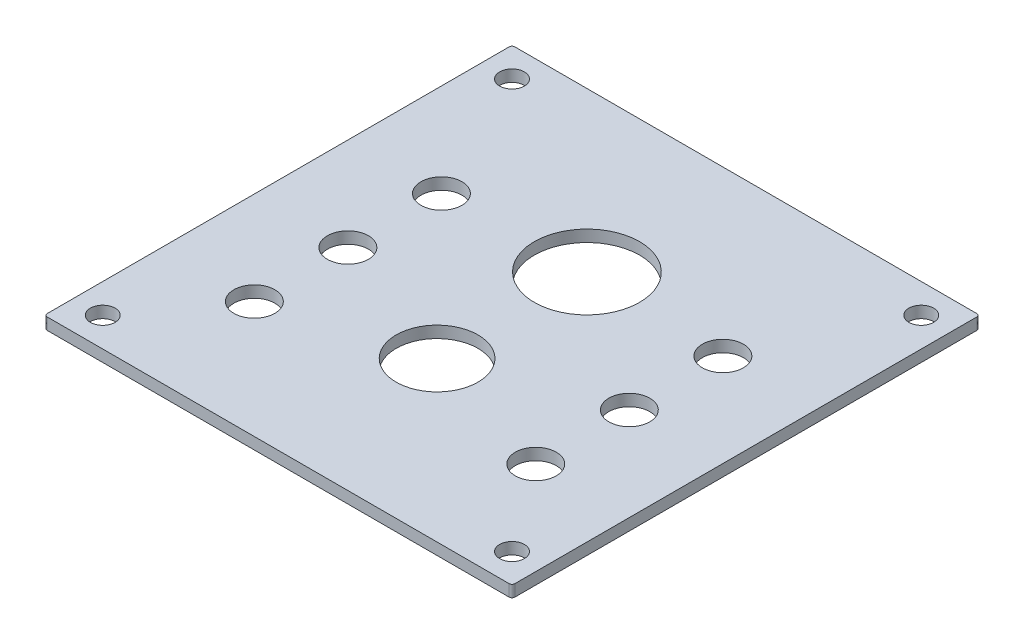
ISO-10303-21;
HEADER;
FILE_DESCRIPTION(('STEP AP214'),'2;1');
FILE_NAME('part.step','',(''),(''),'','','');
FILE_SCHEMA(('AUTOMOTIVE_DESIGN { 1 0 10303 214 1 1 1 1 }'));
ENDSEC;
DATA;
#1=APPLICATION_CONTEXT('core data for automotive mechanical design processes');
#2=APPLICATION_PROTOCOL_DEFINITION('international standard','automotive_design',2000,#1);
#3=PRODUCT_CONTEXT('',#1,'mechanical');
#4=PRODUCT('Part','Part','',(#3));
#5=PRODUCT_RELATED_PRODUCT_CATEGORY('part','',(#4));
#6=PRODUCT_DEFINITION_FORMATION('','',#4);
#7=PRODUCT_DEFINITION_CONTEXT('part definition',#1,'design');
#8=PRODUCT_DEFINITION('design','',#6,#7);
#9=PRODUCT_DEFINITION_SHAPE('','',#8);
#10=(LENGTH_UNIT() NAMED_UNIT(*) SI_UNIT(.MILLI.,.METRE.));
#11=(NAMED_UNIT(*) PLANE_ANGLE_UNIT() SI_UNIT($,.RADIAN.));
#12=(NAMED_UNIT(*) SI_UNIT($,.STERADIAN.) SOLID_ANGLE_UNIT());
#13=UNCERTAINTY_MEASURE_WITH_UNIT(LENGTH_MEASURE(1.E-05),#10,'distance_accuracy_value','');
#14=(GEOMETRIC_REPRESENTATION_CONTEXT(3) GLOBAL_UNCERTAINTY_ASSIGNED_CONTEXT((#13)) GLOBAL_UNIT_ASSIGNED_CONTEXT((#10,
#11,#12)) REPRESENTATION_CONTEXT('',''));
#15=CARTESIAN_POINT('',(0.,0.,0.));
#16=DIRECTION('',(0.,0.,1.));
#17=DIRECTION('',(1.,0.,0.));
#18=AXIS2_PLACEMENT_3D('',#15,#16,#17);
#19=CARTESIAN_POINT('',(76.3793482316,0.,47.8960233086));
#20=DIRECTION('',(0.,-1.,0.));
#21=DIRECTION('',(0.,0.,-1.));
#22=AXIS2_PLACEMENT_3D('',#19,#20,#21);
#23=CYLINDRICAL_SURFACE('',#22,0.79375000000001);
#24=DIRECTION('',(0.,1.,0.));
#25=VECTOR('',#24,1.);
#26=CARTESIAN_POINT('',(77.1730982344487,0.,47.8960233086));
#27=LINE('',#26,#25);
#28=CARTESIAN_POINT('',(77.1730982330243,-3.175,47.8960233086));
#29=VERTEX_POINT('',#28);
#30=CARTESIAN_POINT('',(77.1730982330243,0.,47.8960233086));
#31=VERTEX_POINT('',#30);
#32=EDGE_CURVE('E101',#29,#31,#27,.T.);
#33=ORIENTED_EDGE('',*,*,#32,.T.);
#34=CARTESIAN_POINT('',(76.3793482316,0.,47.8960233086));
#35=DIRECTION('',(0.,-1.,0.));
#36=DIRECTION('',(0.,0.,-1.));
#37=AXIS2_PLACEMENT_3D('',#34,#35,#36);
#38=CIRCLE('',#37,0.79375000000001);
#39=CARTESIAN_POINT('',(76.3793482316,0.,48.6897733032364));
#40=VERTEX_POINT('',#39);
#41=EDGE_CURVE('E20',#40,#31,#38,.F.);
#42=ORIENTED_EDGE('',*,*,#41,.F.);
#43=DIRECTION('',(0.,1.,0.));
#44=VECTOR('',#43,1.);
#45=CARTESIAN_POINT('',(76.3793482316,0.,48.6897732978727));
#46=LINE('',#45,#44);
#47=CARTESIAN_POINT('',(76.3793482316,-3.175,48.6897733032364));
#48=VERTEX_POINT('',#47);
#49=EDGE_CURVE('E112',#40,#48,#46,.F.);
#50=ORIENTED_EDGE('',*,*,#49,.T.);
#51=CARTESIAN_POINT('',(76.3793482316,-3.175,47.8960233086));
#52=DIRECTION('',(0.,-1.,0.));
#53=DIRECTION('',(0.,0.,-1.));
#54=AXIS2_PLACEMENT_3D('',#51,#52,#53);
#55=CIRCLE('',#54,0.79375000000001);
#56=EDGE_CURVE('E213',#29,#48,#55,.T.);
#57=ORIENTED_EDGE('',*,*,#56,.F.);
#58=EDGE_LOOP('',(#33,#42,#50,#57));
#59=FACE_BOUND('',#58,.T.);
#60=ADVANCED_FACE('F17',(#59),#23,.T.);
#61=CARTESIAN_POINT('',(-49.0331517684,0.,47.8960233086));
#62=DIRECTION('',(0.,-1.,0.));
#63=DIRECTION('',(0.,0.,-1.));
#64=AXIS2_PLACEMENT_3D('',#61,#62,#63);
#65=CYLINDRICAL_SURFACE('',#64,0.793749999999996);
#66=DIRECTION('',(0.,1.,0.));
#67=VECTOR('',#66,1.);
#68=CARTESIAN_POINT('',(-49.0331517684,0.,48.6897732978727));
#69=LINE('',#68,#67);
#70=CARTESIAN_POINT('',(-49.0331517684,-3.175,48.6897733032364));
#71=VERTEX_POINT('',#70);
#72=CARTESIAN_POINT('',(-49.0331517684,0.,48.6897733032364));
#73=VERTEX_POINT('',#72);
#74=EDGE_CURVE('E132',#71,#73,#69,.T.);
#75=ORIENTED_EDGE('',*,*,#74,.T.);
#76=CARTESIAN_POINT('',(-49.0331517684,0.,47.8960233086));
#77=DIRECTION('',(0.,-1.,0.));
#78=DIRECTION('',(0.,0.,-1.));
#79=AXIS2_PLACEMENT_3D('',#76,#77,#78);
#80=CIRCLE('',#79,0.793749999999996);
#81=CARTESIAN_POINT('',(-49.8269017669757,0.,47.8960233086));
#82=VERTEX_POINT('',#81);
#83=EDGE_CURVE('E212',#82,#73,#80,.F.);
#84=ORIENTED_EDGE('',*,*,#83,.F.);
#85=DIRECTION('',(0.,1.,0.));
#86=VECTOR('',#85,1.);
#87=CARTESIAN_POINT('',(-49.8269017655513,0.,47.8960233086));
#88=LINE('',#87,#86);
#89=CARTESIAN_POINT('',(-49.8269017669757,-3.175,47.8960233086));
#90=VERTEX_POINT('',#89);
#91=EDGE_CURVE('E111',#82,#90,#88,.F.);
#92=ORIENTED_EDGE('',*,*,#91,.T.);
#93=CARTESIAN_POINT('',(-49.0331517684,-3.175,47.8960233086));
#94=DIRECTION('',(0.,-1.,0.));
#95=DIRECTION('',(0.,0.,-1.));
#96=AXIS2_PLACEMENT_3D('',#93,#94,#95);
#97=CIRCLE('',#96,0.793749999999996);
#98=EDGE_CURVE('E116',#71,#90,#97,.T.);
#99=ORIENTED_EDGE('',*,*,#98,.F.);
#100=EDGE_LOOP('',(#75,#84,#92,#99));
#101=FACE_BOUND('',#100,.T.);
#102=ADVANCED_FACE('F222',(#101),#65,.T.);
#103=CARTESIAN_POINT('',(76.3793482316,0.,-77.5164766914));
#104=DIRECTION('',(0.,-1.,0.));
#105=DIRECTION('',(0.,0.,-1.));
#106=AXIS2_PLACEMENT_3D('',#103,#104,#105);
#107=CYLINDRICAL_SURFACE('',#106,0.79375000000001);
#108=DIRECTION('',(0.,1.,0.));
#109=VECTOR('',#108,1.);
#110=CARTESIAN_POINT('',(76.3793482316,0.,-78.3102266698692));
#111=LINE('',#110,#109);
#112=CARTESIAN_POINT('',(76.3793482316,-3.175,-78.3102266806346));
#113=VERTEX_POINT('',#112);
#114=CARTESIAN_POINT('',(76.3793482316,0.,-78.3102266806346));
#115=VERTEX_POINT('',#114);
#116=EDGE_CURVE('E128',#113,#115,#111,.T.);
#117=ORIENTED_EDGE('',*,*,#116,.T.);
#118=CARTESIAN_POINT('',(76.3793482316,0.,-77.5164766914));
#119=DIRECTION('',(0.,-1.,0.));
#120=DIRECTION('',(0.,0.,-1.));
#121=AXIS2_PLACEMENT_3D('',#118,#119,#120);
#122=CIRCLE('',#121,0.79375000000001);
#123=CARTESIAN_POINT('',(77.1730982330243,0.,-77.5164766914));
#124=VERTEX_POINT('',#123);
#125=EDGE_CURVE('E35',#124,#115,#122,.F.);
#126=ORIENTED_EDGE('',*,*,#125,.F.);
#127=DIRECTION('',(0.,1.,0.));
#128=VECTOR('',#127,1.);
#129=CARTESIAN_POINT('',(77.1730982344487,0.,-77.5164766914));
#130=LINE('',#129,#128);
#131=CARTESIAN_POINT('',(77.1730982330243,-3.175,-77.5164766914));
#132=VERTEX_POINT('',#131);
#133=EDGE_CURVE('E135',#124,#132,#130,.F.);
#134=ORIENTED_EDGE('',*,*,#133,.T.);
#135=CARTESIAN_POINT('',(76.3793482316,-3.175,-77.5164766914));
#136=DIRECTION('',(0.,-1.,0.));
#137=DIRECTION('',(0.,0.,-1.));
#138=AXIS2_PLACEMENT_3D('',#135,#136,#137);
#139=CIRCLE('',#138,0.79375000000001);
#140=EDGE_CURVE('E79',#113,#132,#139,.T.);
#141=ORIENTED_EDGE('',*,*,#140,.F.);
#142=EDGE_LOOP('',(#117,#126,#134,#141));
#143=FACE_BOUND('',#142,.T.);
#144=ADVANCED_FACE('F232',(#143),#107,.T.);
#145=CARTESIAN_POINT('',(-49.0331517684,0.,-77.5164766914));
#146=DIRECTION('',(0.,-1.,0.));
#147=DIRECTION('',(0.,0.,-1.));
#148=AXIS2_PLACEMENT_3D('',#145,#146,#147);
#149=CYLINDRICAL_SURFACE('',#148,0.793750000000003);
#150=DIRECTION('',(0.,1.,0.));
#151=VECTOR('',#150,1.);
#152=CARTESIAN_POINT('',(-49.8269017655513,0.,-77.5164766914));
#153=LINE('',#152,#151);
#154=CARTESIAN_POINT('',(-49.8269017669757,-3.175,-77.5164766914));
#155=VERTEX_POINT('',#154);
#156=CARTESIAN_POINT('',(-49.8269017669757,0.,-77.5164766914));
#157=VERTEX_POINT('',#156);
#158=EDGE_CURVE('E95',#155,#157,#153,.T.);
#159=ORIENTED_EDGE('',*,*,#158,.T.);
#160=CARTESIAN_POINT('',(-49.0331517684,0.,-77.5164766914));
#161=DIRECTION('',(0.,-1.,0.));
#162=DIRECTION('',(0.,0.,-1.));
#163=AXIS2_PLACEMENT_3D('',#160,#161,#162);
#164=CIRCLE('',#163,0.793750000000003);
#165=CARTESIAN_POINT('',(-49.0331517684,0.,-78.3102266806346));
#166=VERTEX_POINT('',#165);
#167=EDGE_CURVE('E102',#166,#157,#164,.F.);
#168=ORIENTED_EDGE('',*,*,#167,.F.);
#169=DIRECTION('',(0.,1.,0.));
#170=VECTOR('',#169,1.);
#171=CARTESIAN_POINT('',(-49.0331517684,0.,-78.3102266698692));
#172=LINE('',#171,#170);
#173=CARTESIAN_POINT('',(-49.0331517684,-3.175,-78.3102266806346));
#174=VERTEX_POINT('',#173);
#175=EDGE_CURVE('E98',#166,#174,#172,.F.);
#176=ORIENTED_EDGE('',*,*,#175,.T.);
#177=CARTESIAN_POINT('',(-49.0331517684,-3.175,-77.5164766914));
#178=DIRECTION('',(0.,-1.,0.));
#179=DIRECTION('',(0.,0.,-1.));
#180=AXIS2_PLACEMENT_3D('',#177,#178,#179);
#181=CIRCLE('',#180,0.793750000000003);
#182=EDGE_CURVE('E92',#155,#174,#181,.T.);
#183=ORIENTED_EDGE('',*,*,#182,.F.);
#184=EDGE_LOOP('',(#159,#168,#176,#183));
#185=FACE_BOUND('',#184,.T.);
#186=ADVANCED_FACE('F94',(#185),#149,.T.);
#187=CARTESIAN_POINT('',(77.1730982344487,0.,0.));
#188=DIRECTION('',(1.,0.,0.));
#189=DIRECTION('',(0.,0.,-1.));
#190=AXIS2_PLACEMENT_3D('',#187,#188,#189);
#191=PLANE('',#190);
#192=ORIENTED_EDGE('',*,*,#133,.F.);
#193=DIRECTION('',(0.,0.,-1.));
#194=VECTOR('',#193,1.);
#195=CARTESIAN_POINT('',(77.1730982316,0.,0.));
#196=LINE('',#195,#194);
#197=EDGE_CURVE('E177',#124,#31,#196,.F.);
#198=ORIENTED_EDGE('',*,*,#197,.T.);
#199=ORIENTED_EDGE('',*,*,#32,.F.);
#200=DIRECTION('',(0.,0.,-1.));
#201=VECTOR('',#200,1.);
#202=CARTESIAN_POINT('',(77.1730982316,-3.17499999967742,0.));
#203=LINE('',#202,#201);
#204=EDGE_CURVE('E122',#29,#132,#203,.T.);
#205=ORIENTED_EDGE('',*,*,#204,.T.);
#206=EDGE_LOOP('',(#192,#198,#199,#205));
#207=FACE_BOUND('',#206,.T.);
#208=ADVANCED_FACE('F231',(#207),#191,.T.);
#209=CARTESIAN_POINT('',(0.,0.,48.6897732978727));
#210=DIRECTION('',(0.,0.,1.));
#211=DIRECTION('',(1.,0.,0.));
#212=AXIS2_PLACEMENT_3D('',#209,#210,#211);
#213=PLANE('',#212);
#214=ORIENTED_EDGE('',*,*,#49,.F.);
#215=DIRECTION('',(1.,0.,0.));
#216=VECTOR('',#215,1.);
#217=CARTESIAN_POINT('',(0.,0.,48.6897733086));
#218=LINE('',#217,#216);
#219=EDGE_CURVE('E220',#40,#73,#218,.F.);
#220=ORIENTED_EDGE('',*,*,#219,.T.);
#221=ORIENTED_EDGE('',*,*,#74,.F.);
#222=DIRECTION('',(1.,0.,0.));
#223=VECTOR('',#222,1.);
#224=CARTESIAN_POINT('',(0.,-3.17499999967742,48.6897733086));
#225=LINE('',#224,#223);
#226=EDGE_CURVE('E118',#71,#48,#225,.T.);
#227=ORIENTED_EDGE('',*,*,#226,.T.);
#228=EDGE_LOOP('',(#214,#220,#221,#227));
#229=FACE_BOUND('',#228,.T.);
#230=ADVANCED_FACE('F219',(#229),#213,.T.);
#231=CARTESIAN_POINT('',(-49.8269017655513,0.,0.));
#232=DIRECTION('',(-1.,0.,0.));
#233=DIRECTION('',(0.,0.,1.));
#234=AXIS2_PLACEMENT_3D('',#231,#232,#233);
#235=PLANE('',#234);
#236=ORIENTED_EDGE('',*,*,#91,.F.);
#237=DIRECTION('',(0.,0.,-1.));
#238=VECTOR('',#237,1.);
#239=CARTESIAN_POINT('',(-49.8269017684,0.,0.));
#240=LINE('',#239,#238);
#241=EDGE_CURVE('E110',#82,#157,#240,.T.);
#242=ORIENTED_EDGE('',*,*,#241,.T.);
#243=ORIENTED_EDGE('',*,*,#158,.F.);
#244=DIRECTION('',(0.,0.,-1.));
#245=VECTOR('',#244,1.);
#246=CARTESIAN_POINT('',(-49.8269017684,-3.17499999967742,0.));
#247=LINE('',#246,#245);
#248=EDGE_CURVE('E108',#155,#90,#247,.F.);
#249=ORIENTED_EDGE('',*,*,#248,.T.);
#250=EDGE_LOOP('',(#236,#242,#243,#249));
#251=FACE_BOUND('',#250,.T.);
#252=ADVANCED_FACE('F107',(#251),#235,.T.);
#253=CARTESIAN_POINT('',(0.,0.,-78.3102266698692));
#254=DIRECTION('',(0.,0.,-1.));
#255=DIRECTION('',(-1.,0.,0.));
#256=AXIS2_PLACEMENT_3D('',#253,#254,#255);
#257=PLANE('',#256);
#258=ORIENTED_EDGE('',*,*,#175,.F.);
#259=DIRECTION('',(1.,0.,0.));
#260=VECTOR('',#259,1.);
#261=CARTESIAN_POINT('',(0.,0.,-78.3102266914));
#262=LINE('',#261,#260);
#263=EDGE_CURVE('E173',#166,#115,#262,.T.);
#264=ORIENTED_EDGE('',*,*,#263,.T.);
#265=ORIENTED_EDGE('',*,*,#116,.F.);
#266=DIRECTION('',(1.,0.,0.));
#267=VECTOR('',#266,1.);
#268=CARTESIAN_POINT('',(0.,-3.17499999967742,-78.3102266914));
#269=LINE('',#268,#267);
#270=EDGE_CURVE('E119',#113,#174,#269,.F.);
#271=ORIENTED_EDGE('',*,*,#270,.T.);
#272=EDGE_LOOP('',(#258,#264,#265,#271));
#273=FACE_BOUND('',#272,.T.);
#274=ADVANCED_FACE('F235',(#273),#257,.T.);
#275=CARTESIAN_POINT('',(51.8813432018,0.,-33.8602266914));
#276=DIRECTION('',(0.,-1.,0.));
#277=DIRECTION('',(0.,0.,-1.));
#278=AXIS2_PLACEMENT_3D('',#275,#276,#277);
#279=CYLINDRICAL_SURFACE('',#278,5.5626);
#280=CARTESIAN_POINT('',(51.8813432018,0.,-33.8602266914));
#281=DIRECTION('',(0.,-1.,0.));
#282=DIRECTION('',(0.,0.,-1.));
#283=AXIS2_PLACEMENT_3D('',#280,#281,#282);
#284=CIRCLE('',#283,5.5626);
#285=CARTESIAN_POINT('',(51.8813432018,0.,-39.4228266914));
#286=VERTEX_POINT('',#285);
#287=EDGE_CURVE('E170',#286,#286,#284,.F.);
#288=ORIENTED_EDGE('',*,*,#287,.T.);
#289=EDGE_LOOP('',(#288));
#290=FACE_BOUND('',#289,.T.);
#291=CARTESIAN_POINT('',(51.8813432018,-3.175,-33.8602266914));
#292=DIRECTION('',(0.,-1.,0.));
#293=DIRECTION('',(0.,0.,-1.));
#294=AXIS2_PLACEMENT_3D('',#291,#292,#293);
#295=CIRCLE('',#294,5.5626);
#296=CARTESIAN_POINT('',(51.8813432018,-3.175,-39.4228266914));
#297=VERTEX_POINT('',#296);
#298=EDGE_CURVE('E205',#297,#297,#295,.T.);
#299=ORIENTED_EDGE('',*,*,#298,.T.);
#300=EDGE_LOOP('',(#299));
#301=FACE_BOUND('',#300,.T.);
#302=ADVANCED_FACE('F237',(#290,#301),#279,.F.);
#303=CARTESIAN_POINT('',(-24.53514673098,0.,16.93977329844));
#304=DIRECTION('',(0.,-1.,0.));
#305=DIRECTION('',(0.,0.,-1.));
#306=AXIS2_PLACEMENT_3D('',#303,#304,#305);
#307=CYLINDRICAL_SURFACE('',#306,5.5626);
#308=CARTESIAN_POINT('',(-24.53514673098,0.,16.93977329844));
#309=DIRECTION('',(0.,-1.,0.));
#310=DIRECTION('',(0.,0.,-1.));
#311=AXIS2_PLACEMENT_3D('',#308,#309,#310);
#312=CIRCLE('',#311,5.5626);
#313=CARTESIAN_POINT('',(-24.53514673098,0.,11.37717329844));
#314=VERTEX_POINT('',#313);
#315=EDGE_CURVE('E167',#314,#314,#312,.F.);
#316=ORIENTED_EDGE('',*,*,#315,.T.);
#317=EDGE_LOOP('',(#316));
#318=FACE_BOUND('',#317,.T.);
#319=CARTESIAN_POINT('',(-24.53514673098,-3.175,16.93977329844));
#320=DIRECTION('',(0.,-1.,0.));
#321=DIRECTION('',(0.,0.,-1.));
#322=AXIS2_PLACEMENT_3D('',#319,#320,#321);
#323=CIRCLE('',#322,5.5626);
#324=CARTESIAN_POINT('',(-24.53514673098,-3.175,11.37717329844));
#325=VERTEX_POINT('',#324);
#326=EDGE_CURVE('E202',#325,#325,#323,.T.);
#327=ORIENTED_EDGE('',*,*,#326,.T.);
#328=EDGE_LOOP('',(#327));
#329=FACE_BOUND('',#328,.T.);
#330=ADVANCED_FACE('F244',(#318,#329),#307,.F.);
#331=CARTESIAN_POINT('',(-41.8894017684,0.,40.7522733086));
#332=DIRECTION('',(0.,-1.,0.));
#333=DIRECTION('',(0.,0.,-1.));
#334=AXIS2_PLACEMENT_3D('',#331,#332,#333);
#335=CYLINDRICAL_SURFACE('',#334,3.3528);
#336=CARTESIAN_POINT('',(-41.8894017684,0.,40.7522733086));
#337=DIRECTION('',(0.,-1.,0.));
#338=DIRECTION('',(0.,0.,-1.));
#339=AXIS2_PLACEMENT_3D('',#336,#337,#338);
#340=CIRCLE('',#339,3.3528);
#341=CARTESIAN_POINT('',(-41.8894017684,0.,37.3994733086));
#342=VERTEX_POINT('',#341);
#343=EDGE_CURVE('E164',#342,#342,#340,.F.);
#344=ORIENTED_EDGE('',*,*,#343,.T.);
#345=EDGE_LOOP('',(#344));
#346=FACE_BOUND('',#345,.T.);
#347=CARTESIAN_POINT('',(-41.8894017684,-3.175,40.7522733086));
#348=DIRECTION('',(0.,-1.,0.));
#349=DIRECTION('',(0.,0.,-1.));
#350=AXIS2_PLACEMENT_3D('',#347,#348,#349);
#351=CIRCLE('',#350,3.3528);
#352=CARTESIAN_POINT('',(-41.8894017684,-3.175,37.3994733086));
#353=VERTEX_POINT('',#352);
#354=EDGE_CURVE('E199',#353,#353,#351,.T.);
#355=ORIENTED_EDGE('',*,*,#354,.T.);
#356=EDGE_LOOP('',(#355));
#357=FACE_BOUND('',#356,.T.);
#358=ADVANCED_FACE('F294',(#346,#357),#335,.F.);
#359=CARTESIAN_POINT('',(13.67309823668,0.,5.53517330098));
#360=DIRECTION('',(0.,-1.,0.));
#361=DIRECTION('',(0.,0.,-1.));
#362=AXIS2_PLACEMENT_3D('',#359,#360,#361);
#363=CYLINDRICAL_SURFACE('',#362,11.1125);
#364=CARTESIAN_POINT('',(13.67309823668,0.,5.53517330098));
#365=DIRECTION('',(0.,-1.,0.));
#366=DIRECTION('',(0.,0.,-1.));
#367=AXIS2_PLACEMENT_3D('',#364,#365,#366);
#368=CIRCLE('',#367,11.1125);
#369=CARTESIAN_POINT('',(13.67309823668,0.,-5.57732669902));
#370=VERTEX_POINT('',#369);
#371=EDGE_CURVE('E161',#370,#370,#368,.F.);
#372=ORIENTED_EDGE('',*,*,#371,.T.);
#373=EDGE_LOOP('',(#372));
#374=FACE_BOUND('',#373,.T.);
#375=CARTESIAN_POINT('',(13.67309823668,-3.175,5.53517330098));
#376=DIRECTION('',(0.,-1.,0.));
#377=DIRECTION('',(0.,0.,-1.));
#378=AXIS2_PLACEMENT_3D('',#375,#376,#377);
#379=CIRCLE('',#378,11.1125);
#380=CARTESIAN_POINT('',(13.67309823668,-3.175,-5.57732669902));
#381=VERTEX_POINT('',#380);
#382=EDGE_CURVE('E196',#381,#381,#379,.T.);
#383=ORIENTED_EDGE('',*,*,#382,.T.);
#384=EDGE_LOOP('',(#383));
#385=FACE_BOUND('',#384,.T.);
#386=ADVANCED_FACE('F290',(#374,#385),#363,.F.);
#387=CARTESIAN_POINT('',(69.2355982316,0.,-70.3727266914));
#388=DIRECTION('',(0.,-1.,0.));
#389=DIRECTION('',(0.,0.,-1.));
#390=AXIS2_PLACEMENT_3D('',#387,#388,#389);
#391=CYLINDRICAL_SURFACE('',#390,3.35279999999999);
#392=CARTESIAN_POINT('',(69.2355982316,0.,-70.3727266914));
#393=DIRECTION('',(0.,-1.,0.));
#394=DIRECTION('',(0.,0.,-1.));
#395=AXIS2_PLACEMENT_3D('',#392,#393,#394);
#396=CIRCLE('',#395,3.35279999999999);
#397=CARTESIAN_POINT('',(69.2355982316,0.,-73.7255266914));
#398=VERTEX_POINT('',#397);
#399=EDGE_CURVE('E158',#398,#398,#396,.F.);
#400=ORIENTED_EDGE('',*,*,#399,.T.);
#401=EDGE_LOOP('',(#400));
#402=FACE_BOUND('',#401,.T.);
#403=CARTESIAN_POINT('',(69.2355982316,-3.175,-70.3727266914));
#404=DIRECTION('',(0.,-1.,0.));
#405=DIRECTION('',(0.,0.,-1.));
#406=AXIS2_PLACEMENT_3D('',#403,#404,#405);
#407=CIRCLE('',#406,3.35279999999999);
#408=CARTESIAN_POINT('',(69.2355982316,-3.175,-73.7255266914));
#409=VERTEX_POINT('',#408);
#410=EDGE_CURVE('E193',#409,#409,#407,.T.);
#411=ORIENTED_EDGE('',*,*,#410,.T.);
#412=EDGE_LOOP('',(#411));
#413=FACE_BOUND('',#412,.T.);
#414=ADVANCED_FACE('F286',(#402,#413),#391,.F.);
#415=CARTESIAN_POINT('',(69.2355982316,0.,40.7522733086));
#416=DIRECTION('',(0.,-1.,0.));
#417=DIRECTION('',(0.,0.,-1.));
#418=AXIS2_PLACEMENT_3D('',#415,#416,#417);
#419=CYLINDRICAL_SURFACE('',#418,3.3528);
#420=CARTESIAN_POINT('',(69.2355982316,0.,40.7522733086));
#421=DIRECTION('',(0.,-1.,0.));
#422=DIRECTION('',(0.,0.,-1.));
#423=AXIS2_PLACEMENT_3D('',#420,#421,#422);
#424=CIRCLE('',#423,3.3528);
#425=CARTESIAN_POINT('',(69.2355982316,0.,37.3994733086));
#426=VERTEX_POINT('',#425);
#427=EDGE_CURVE('E155',#426,#426,#424,.F.);
#428=ORIENTED_EDGE('',*,*,#427,.T.);
#429=EDGE_LOOP('',(#428));
#430=FACE_BOUND('',#429,.T.);
#431=CARTESIAN_POINT('',(69.2355982316,-3.175,40.7522733086));
#432=DIRECTION('',(0.,-1.,0.));
#433=DIRECTION('',(0.,0.,-1.));
#434=AXIS2_PLACEMENT_3D('',#431,#432,#433);
#435=CIRCLE('',#434,3.3528);
#436=CARTESIAN_POINT('',(69.2355982316,-3.175,37.3994733086));
#437=VERTEX_POINT('',#436);
#438=EDGE_CURVE('E190',#437,#437,#435,.T.);
#439=ORIENTED_EDGE('',*,*,#438,.T.);
#440=EDGE_LOOP('',(#439));
#441=FACE_BOUND('',#440,.T.);
#442=ADVANCED_FACE('F282',(#430,#441),#419,.F.);
#443=CARTESIAN_POINT('',(-41.8894017684,0.,-70.3727266914));
#444=DIRECTION('',(0.,-1.,0.));
#445=DIRECTION('',(0.,0.,-1.));
#446=AXIS2_PLACEMENT_3D('',#443,#444,#445);
#447=CYLINDRICAL_SURFACE('',#446,3.35279999999999);
#448=CARTESIAN_POINT('',(-41.8894017684,0.,-70.3727266914));
#449=DIRECTION('',(0.,-1.,0.));
#450=DIRECTION('',(0.,0.,-1.));
#451=AXIS2_PLACEMENT_3D('',#448,#449,#450);
#452=CIRCLE('',#451,3.35279999999999);
#453=CARTESIAN_POINT('',(-41.8894017684,0.,-73.7255266914));
#454=VERTEX_POINT('',#453);
#455=EDGE_CURVE('E152',#454,#454,#452,.F.);
#456=ORIENTED_EDGE('',*,*,#455,.T.);
#457=EDGE_LOOP('',(#456));
#458=FACE_BOUND('',#457,.T.);
#459=CARTESIAN_POINT('',(-41.8894017684,-3.175,-70.3727266914));
#460=DIRECTION('',(0.,-1.,0.));
#461=DIRECTION('',(0.,0.,-1.));
#462=AXIS2_PLACEMENT_3D('',#459,#460,#461);
#463=CIRCLE('',#462,3.35279999999999);
#464=CARTESIAN_POINT('',(-41.8894017684,-3.175,-73.7255266914));
#465=VERTEX_POINT('',#464);
#466=EDGE_CURVE('E187',#465,#465,#463,.T.);
#467=ORIENTED_EDGE('',*,*,#466,.T.);
#468=EDGE_LOOP('',(#467));
#469=FACE_BOUND('',#468,.T.);
#470=ADVANCED_FACE('F278',(#458,#469),#447,.F.);
#471=CARTESIAN_POINT('',(13.67309823668,0.,-35.1556266914));
#472=DIRECTION('',(0.,-1.,0.));
#473=DIRECTION('',(0.,0.,-1.));
#474=AXIS2_PLACEMENT_3D('',#471,#472,#473);
#475=CYLINDRICAL_SURFACE('',#474,14.2875);
#476=CARTESIAN_POINT('',(13.67309823668,0.,-35.1556266914));
#477=DIRECTION('',(0.,-1.,0.));
#478=DIRECTION('',(0.,0.,-1.));
#479=AXIS2_PLACEMENT_3D('',#476,#477,#478);
#480=CIRCLE('',#479,14.2875);
#481=CARTESIAN_POINT('',(13.67309823668,0.,-49.4431266914));
#482=VERTEX_POINT('',#481);
#483=EDGE_CURVE('E149',#482,#482,#480,.F.);
#484=ORIENTED_EDGE('',*,*,#483,.T.);
#485=EDGE_LOOP('',(#484));
#486=FACE_BOUND('',#485,.T.);
#487=CARTESIAN_POINT('',(13.67309823668,-3.175,-35.1556266914));
#488=DIRECTION('',(0.,-1.,0.));
#489=DIRECTION('',(0.,0.,-1.));
#490=AXIS2_PLACEMENT_3D('',#487,#488,#489);
#491=CIRCLE('',#490,14.2875);
#492=CARTESIAN_POINT('',(13.67309823668,-3.175,-49.4431266914));
#493=VERTEX_POINT('',#492);
#494=EDGE_CURVE('E184',#493,#493,#491,.T.);
#495=ORIENTED_EDGE('',*,*,#494,.T.);
#496=EDGE_LOOP('',(#495));
#497=FACE_BOUND('',#496,.T.);
#498=ADVANCED_FACE('F274',(#486,#497),#475,.F.);
#499=CARTESIAN_POINT('',(-24.53514673098,0.,-8.46022669902001));
#500=DIRECTION('',(0.,-1.,0.));
#501=DIRECTION('',(0.,0.,-1.));
#502=AXIS2_PLACEMENT_3D('',#499,#500,#501);
#503=CYLINDRICAL_SURFACE('',#502,5.5626);
#504=CARTESIAN_POINT('',(-24.53514673098,0.,-8.46022669902001));
#505=DIRECTION('',(0.,-1.,0.));
#506=DIRECTION('',(0.,0.,-1.));
#507=AXIS2_PLACEMENT_3D('',#504,#505,#506);
#508=CIRCLE('',#507,5.5626);
#509=CARTESIAN_POINT('',(-24.53514673098,0.,-14.02282669902));
#510=VERTEX_POINT('',#509);
#511=EDGE_CURVE('E146',#510,#510,#508,.F.);
#512=ORIENTED_EDGE('',*,*,#511,.T.);
#513=EDGE_LOOP('',(#512));
#514=FACE_BOUND('',#513,.T.);
#515=CARTESIAN_POINT('',(-24.53514673098,-3.175,-8.46022669902001));
#516=DIRECTION('',(0.,-1.,0.));
#517=DIRECTION('',(0.,0.,-1.));
#518=AXIS2_PLACEMENT_3D('',#515,#516,#517);
#519=CIRCLE('',#518,5.5626);
#520=CARTESIAN_POINT('',(-24.53514673098,-3.175,-14.02282669902));
#521=VERTEX_POINT('',#520);
#522=EDGE_CURVE('E181',#521,#521,#519,.T.);
#523=ORIENTED_EDGE('',*,*,#522,.T.);
#524=EDGE_LOOP('',(#523));
#525=FACE_BOUND('',#524,.T.);
#526=ADVANCED_FACE('F270',(#514,#525),#503,.F.);
#527=CARTESIAN_POINT('',(51.8813432018,0.,16.93977329844));
#528=DIRECTION('',(0.,-1.,0.));
#529=DIRECTION('',(0.,0.,-1.));
#530=AXIS2_PLACEMENT_3D('',#527,#528,#529);
#531=CYLINDRICAL_SURFACE('',#530,5.5626);
#532=CARTESIAN_POINT('',(51.8813432018,0.,16.93977329844));
#533=DIRECTION('',(0.,-1.,0.));
#534=DIRECTION('',(0.,0.,-1.));
#535=AXIS2_PLACEMENT_3D('',#532,#533,#534);
#536=CIRCLE('',#535,5.5626);
#537=CARTESIAN_POINT('',(51.8813432018,0.,11.37717329844));
#538=VERTEX_POINT('',#537);
#539=EDGE_CURVE('E143',#538,#538,#536,.F.);
#540=ORIENTED_EDGE('',*,*,#539,.T.);
#541=EDGE_LOOP('',(#540));
#542=FACE_BOUND('',#541,.T.);
#543=CARTESIAN_POINT('',(51.8813432018,-3.175,16.93977329844));
#544=DIRECTION('',(0.,-1.,0.));
#545=DIRECTION('',(0.,0.,-1.));
#546=AXIS2_PLACEMENT_3D('',#543,#544,#545);
#547=CIRCLE('',#546,5.5626);
#548=CARTESIAN_POINT('',(51.8813432018,-3.175,11.37717329844));
#549=VERTEX_POINT('',#548);
#550=EDGE_CURVE('E178',#549,#549,#547,.T.);
#551=ORIENTED_EDGE('',*,*,#550,.T.);
#552=EDGE_LOOP('',(#551));
#553=FACE_BOUND('',#552,.T.);
#554=ADVANCED_FACE('F266',(#542,#553),#531,.F.);
#555=CARTESIAN_POINT('',(-24.53514673098,0.,-33.8602266914));
#556=DIRECTION('',(0.,-1.,0.));
#557=DIRECTION('',(0.,0.,-1.));
#558=AXIS2_PLACEMENT_3D('',#555,#556,#557);
#559=CYLINDRICAL_SURFACE('',#558,5.5626);
#560=CARTESIAN_POINT('',(-24.53514673098,0.,-33.8602266914));
#561=DIRECTION('',(0.,-1.,0.));
#562=DIRECTION('',(0.,0.,-1.));
#563=AXIS2_PLACEMENT_3D('',#560,#561,#562);
#564=CIRCLE('',#563,5.5626);
#565=CARTESIAN_POINT('',(-24.53514673098,0.,-39.4228266914));
#566=VERTEX_POINT('',#565);
#567=EDGE_CURVE('E140',#566,#566,#564,.F.);
#568=ORIENTED_EDGE('',*,*,#567,.T.);
#569=EDGE_LOOP('',(#568));
#570=FACE_BOUND('',#569,.T.);
#571=CARTESIAN_POINT('',(-24.53514673098,-3.175,-33.8602266914));
#572=DIRECTION('',(0.,-1.,0.));
#573=DIRECTION('',(0.,0.,-1.));
#574=AXIS2_PLACEMENT_3D('',#571,#572,#573);
#575=CIRCLE('',#574,5.5626);
#576=CARTESIAN_POINT('',(-24.53514673098,-3.175,-39.4228266914));
#577=VERTEX_POINT('',#576);
#578=EDGE_CURVE('E174',#577,#577,#575,.T.);
#579=ORIENTED_EDGE('',*,*,#578,.T.);
#580=EDGE_LOOP('',(#579));
#581=FACE_BOUND('',#580,.T.);
#582=ADVANCED_FACE('F262',(#570,#581),#559,.F.);
#583=CARTESIAN_POINT('',(0.,-3.17499999967742,0.));
#584=DIRECTION('',(0.,-1.,0.));
#585=DIRECTION('',(0.,0.,-1.));
#586=AXIS2_PLACEMENT_3D('',#583,#584,#585);
#587=PLANE('',#586);
#588=ORIENTED_EDGE('',*,*,#578,.F.);
#589=EDGE_LOOP('',(#588));
#590=FACE_BOUND('',#589,.T.);
#591=ORIENTED_EDGE('',*,*,#550,.F.);
#592=EDGE_LOOP('',(#591));
#593=FACE_BOUND('',#592,.T.);
#594=ORIENTED_EDGE('',*,*,#522,.F.);
#595=EDGE_LOOP('',(#594));
#596=FACE_BOUND('',#595,.T.);
#597=ORIENTED_EDGE('',*,*,#494,.F.);
#598=EDGE_LOOP('',(#597));
#599=FACE_BOUND('',#598,.T.);
#600=ORIENTED_EDGE('',*,*,#466,.F.);
#601=EDGE_LOOP('',(#600));
#602=FACE_BOUND('',#601,.T.);
#603=ORIENTED_EDGE('',*,*,#438,.F.);
#604=EDGE_LOOP('',(#603));
#605=FACE_BOUND('',#604,.T.);
#606=ORIENTED_EDGE('',*,*,#410,.F.);
#607=EDGE_LOOP('',(#606));
#608=FACE_BOUND('',#607,.T.);
#609=ORIENTED_EDGE('',*,*,#382,.F.);
#610=EDGE_LOOP('',(#609));
#611=FACE_BOUND('',#610,.T.);
#612=ORIENTED_EDGE('',*,*,#354,.F.);
#613=EDGE_LOOP('',(#612));
#614=FACE_BOUND('',#613,.T.);
#615=ORIENTED_EDGE('',*,*,#326,.F.);
#616=EDGE_LOOP('',(#615));
#617=FACE_BOUND('',#616,.T.);
#618=ORIENTED_EDGE('',*,*,#298,.F.);
#619=EDGE_LOOP('',(#618));
#620=FACE_BOUND('',#619,.T.);
#621=CARTESIAN_POINT('',(51.8813432018,-3.175,-8.46022669902001));
#622=DIRECTION('',(0.,-1.,0.));
#623=DIRECTION('',(0.,0.,-1.));
#624=AXIS2_PLACEMENT_3D('',#621,#622,#623);
#625=CIRCLE('',#624,5.5626);
#626=CARTESIAN_POINT('',(51.8813432018,-3.175,-14.02282669902));
#627=VERTEX_POINT('',#626);
#628=EDGE_CURVE('E26',#627,#627,#625,.F.);
#629=ORIENTED_EDGE('',*,*,#628,.T.);
#630=EDGE_LOOP('',(#629));
#631=FACE_BOUND('',#630,.T.);
#632=ORIENTED_EDGE('',*,*,#204,.F.);
#633=ORIENTED_EDGE('',*,*,#56,.T.);
#634=ORIENTED_EDGE('',*,*,#226,.F.);
#635=ORIENTED_EDGE('',*,*,#98,.T.);
#636=ORIENTED_EDGE('',*,*,#248,.F.);
#637=ORIENTED_EDGE('',*,*,#182,.T.);
#638=ORIENTED_EDGE('',*,*,#270,.F.);
#639=ORIENTED_EDGE('',*,*,#140,.T.);
#640=EDGE_LOOP('',(#632,#633,#634,#635,#636,#637,#638,#639));
#641=FACE_BOUND('',#640,.T.);
#642=ADVANCED_FACE('F114',(#590,#593,#596,#599,#602,#605,#608,#611,#614,#617,#620,#631,#641),
#587,.T.);
#643=CARTESIAN_POINT('',(0.,0.,0.));
#644=DIRECTION('',(0.,-1.,0.));
#645=DIRECTION('',(0.,0.,-1.));
#646=AXIS2_PLACEMENT_3D('',#643,#644,#645);
#647=PLANE('',#646);
#648=ORIENTED_EDGE('',*,*,#567,.F.);
#649=EDGE_LOOP('',(#648));
#650=FACE_BOUND('',#649,.T.);
#651=ORIENTED_EDGE('',*,*,#539,.F.);
#652=EDGE_LOOP('',(#651));
#653=FACE_BOUND('',#652,.T.);
#654=ORIENTED_EDGE('',*,*,#511,.F.);
#655=EDGE_LOOP('',(#654));
#656=FACE_BOUND('',#655,.T.);
#657=ORIENTED_EDGE('',*,*,#483,.F.);
#658=EDGE_LOOP('',(#657));
#659=FACE_BOUND('',#658,.T.);
#660=ORIENTED_EDGE('',*,*,#455,.F.);
#661=EDGE_LOOP('',(#660));
#662=FACE_BOUND('',#661,.T.);
#663=ORIENTED_EDGE('',*,*,#427,.F.);
#664=EDGE_LOOP('',(#663));
#665=FACE_BOUND('',#664,.T.);
#666=ORIENTED_EDGE('',*,*,#399,.F.);
#667=EDGE_LOOP('',(#666));
#668=FACE_BOUND('',#667,.T.);
#669=ORIENTED_EDGE('',*,*,#371,.F.);
#670=EDGE_LOOP('',(#669));
#671=FACE_BOUND('',#670,.T.);
#672=ORIENTED_EDGE('',*,*,#343,.F.);
#673=EDGE_LOOP('',(#672));
#674=FACE_BOUND('',#673,.T.);
#675=ORIENTED_EDGE('',*,*,#315,.F.);
#676=EDGE_LOOP('',(#675));
#677=FACE_BOUND('',#676,.T.);
#678=ORIENTED_EDGE('',*,*,#287,.F.);
#679=EDGE_LOOP('',(#678));
#680=FACE_BOUND('',#679,.T.);
#681=CARTESIAN_POINT('',(51.8813432018,0.,-8.46022669902001));
#682=DIRECTION('',(0.,-1.,0.));
#683=DIRECTION('',(0.,0.,-1.));
#684=AXIS2_PLACEMENT_3D('',#681,#682,#683);
#685=CIRCLE('',#684,5.5626);
#686=CARTESIAN_POINT('',(51.8813432018,0.,-14.02282669902));
#687=VERTEX_POINT('',#686);
#688=EDGE_CURVE('E11',#687,#687,#685,.T.);
#689=ORIENTED_EDGE('',*,*,#688,.T.);
#690=EDGE_LOOP('',(#689));
#691=FACE_BOUND('',#690,.T.);
#692=ORIENTED_EDGE('',*,*,#263,.F.);
#693=ORIENTED_EDGE('',*,*,#167,.T.);
#694=ORIENTED_EDGE('',*,*,#241,.F.);
#695=ORIENTED_EDGE('',*,*,#83,.T.);
#696=ORIENTED_EDGE('',*,*,#219,.F.);
#697=ORIENTED_EDGE('',*,*,#41,.T.);
#698=ORIENTED_EDGE('',*,*,#197,.F.);
#699=ORIENTED_EDGE('',*,*,#125,.T.);
#700=EDGE_LOOP('',(#692,#693,#694,#695,#696,#697,#698,#699));
#701=FACE_BOUND('',#700,.T.);
#702=ADVANCED_FACE('F223',(#650,#653,#656,#659,#662,#665,#668,#671,#674,#677,#680,#691,#701),
#647,.F.);
#703=CARTESIAN_POINT('',(51.8813432018,0.,-8.46022669902001));
#704=DIRECTION('',(0.,-1.,0.));
#705=DIRECTION('',(0.,0.,-1.));
#706=AXIS2_PLACEMENT_3D('',#703,#704,#705);
#707=CYLINDRICAL_SURFACE('',#706,5.5626);
#708=ORIENTED_EDGE('',*,*,#628,.F.);
#709=EDGE_LOOP('',(#708));
#710=FACE_BOUND('',#709,.T.);
#711=ORIENTED_EDGE('',*,*,#688,.F.);
#712=EDGE_LOOP('',(#711));
#713=FACE_BOUND('',#712,.T.);
#714=ADVANCED_FACE('F248',(#710,#713),#707,.F.);
#715=CLOSED_SHELL('',(#60,#102,#144,#186,#208,#230,#252,#274,#302,#330,#358,#386,#414,#442,#470,
#498,#526,#554,#582,#642,#702,#714));
#716=MANIFOLD_SOLID_BREP('B1',#715);
#717=ADVANCED_BREP_SHAPE_REPRESENTATION('',(#18,#716),#14);
#718=SHAPE_DEFINITION_REPRESENTATION(#9,#717);
ENDSEC;
END-ISO-10303-21;
